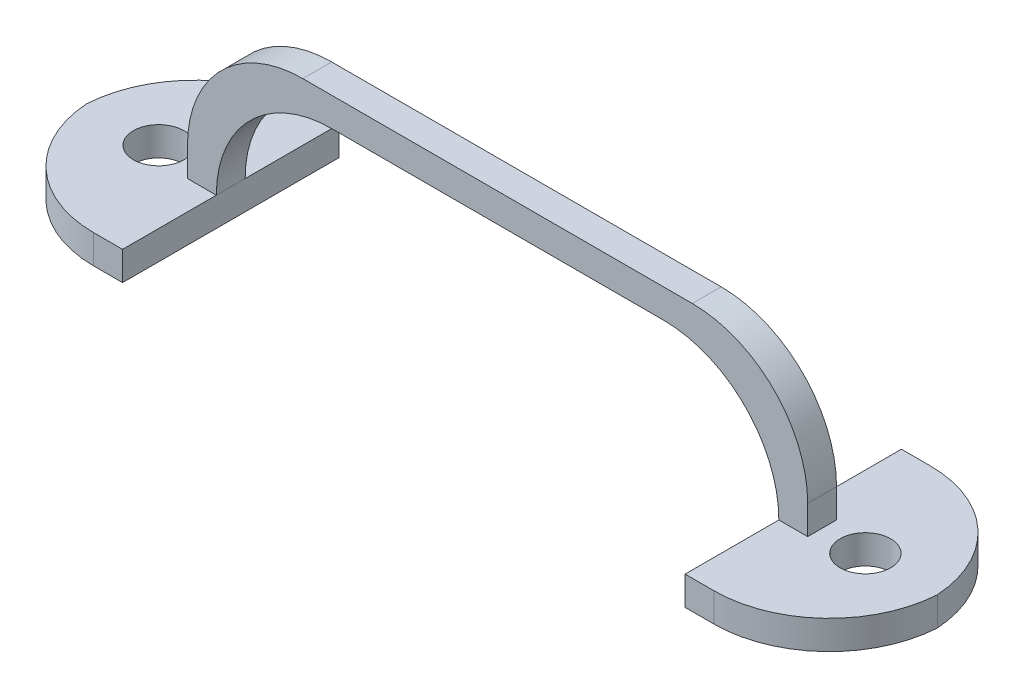
ISO-10303-21;
HEADER;
FILE_DESCRIPTION(('STEP AP214'),'2;1');
FILE_NAME('part.step','',(''),(''),'','','');
FILE_SCHEMA(('AUTOMOTIVE_DESIGN { 1 0 10303 214 1 1 1 1 }'));
ENDSEC;
DATA;
#1=APPLICATION_CONTEXT('core data for automotive mechanical design processes');
#2=APPLICATION_PROTOCOL_DEFINITION('international standard','automotive_design',2000,#1);
#3=PRODUCT_CONTEXT('',#1,'mechanical');
#4=PRODUCT('Part','Part','',(#3));
#5=PRODUCT_RELATED_PRODUCT_CATEGORY('part','',(#4));
#6=PRODUCT_DEFINITION_FORMATION('','',#4);
#7=PRODUCT_DEFINITION_CONTEXT('part definition',#1,'design');
#8=PRODUCT_DEFINITION('design','',#6,#7);
#9=PRODUCT_DEFINITION_SHAPE('','',#8);
#10=(LENGTH_UNIT() NAMED_UNIT(*) SI_UNIT(.MILLI.,.METRE.));
#11=(NAMED_UNIT(*) PLANE_ANGLE_UNIT() SI_UNIT($,.RADIAN.));
#12=(NAMED_UNIT(*) SI_UNIT($,.STERADIAN.) SOLID_ANGLE_UNIT());
#13=UNCERTAINTY_MEASURE_WITH_UNIT(LENGTH_MEASURE(1.E-05),#10,'distance_accuracy_value','');
#14=(GEOMETRIC_REPRESENTATION_CONTEXT(3) GLOBAL_UNCERTAINTY_ASSIGNED_CONTEXT((#13)) GLOBAL_UNIT_ASSIGNED_CONTEXT((#10,
#11,#12)) REPRESENTATION_CONTEXT('',''));
#15=CARTESIAN_POINT('',(0.,0.,0.));
#16=DIRECTION('',(0.,0.,1.));
#17=DIRECTION('',(1.,0.,0.));
#18=AXIS2_PLACEMENT_3D('',#15,#16,#17);
#19=CARTESIAN_POINT('',(0.,2.,0.));
#20=DIRECTION('',(0.,-1.,0.));
#21=DIRECTION('',(0.,0.,-1.));
#22=AXIS2_PLACEMENT_3D('',#19,#20,#21);
#23=PLANE('',#22);
#24=CARTESIAN_POINT('',(-17.6095226530613,2.,8.67295734693881));
#25=DIRECTION('',(0.,1.,0.));
#26=DIRECTION('',(0.,0.,1.));
#27=AXIS2_PLACEMENT_3D('',#24,#25,#26);
#28=CIRCLE('',#27,1.75);
#29=CARTESIAN_POINT('',(-17.6095226530613,2.,10.4229573469388));
#30=VERTEX_POINT('',#29);
#31=EDGE_CURVE('E287',#30,#30,#28,.T.);
#32=ORIENTED_EDGE('',*,*,#31,.F.);
#33=EDGE_LOOP('',(#32));
#34=FACE_BOUND('',#33,.T.);
#35=DIRECTION('',(1.,0.,0.));
#36=VECTOR('',#35,1.);
#37=CARTESIAN_POINT('',(-22.6095226530613,2.,1.17295734693881));
#38=LINE('',#37,#36);
#39=CARTESIAN_POINT('',(-14.6095226530613,2.,1.17295734693881));
#40=VERTEX_POINT('',#39);
#41=CARTESIAN_POINT('',(-12.6095226530613,2.,1.17295734693881));
#42=VERTEX_POINT('',#41);
#43=EDGE_CURVE('E300',#40,#42,#38,.T.);
#44=ORIENTED_EDGE('',*,*,#43,.F.);
#45=CARTESIAN_POINT('',(-14.6095226530613,2.,9.17295734693881));
#46=DIRECTION('',(0.,-1.,0.));
#47=DIRECTION('',(0.,0.,-1.));
#48=AXIS2_PLACEMENT_3D('',#45,#46,#47);
#49=CIRCLE('',#48,8.);
#50=CARTESIAN_POINT('',(-22.5938823643969,2.,8.67295734693881));
#51=VERTEX_POINT('',#50);
#52=EDGE_CURVE('E322',#40,#51,#49,.F.);
#53=ORIENTED_EDGE('',*,*,#52,.T.);
#54=CARTESIAN_POINT('',(-14.6095226530613,2.,8.17295734693881));
#55=DIRECTION('',(0.,-1.,0.));
#56=DIRECTION('',(0.,0.,-1.));
#57=AXIS2_PLACEMENT_3D('',#54,#55,#56);
#58=CIRCLE('',#57,8.);
#59=CARTESIAN_POINT('',(-14.6095226530613,2.,16.1729573469388));
#60=VERTEX_POINT('',#59);
#61=EDGE_CURVE('E320',#51,#60,#58,.F.);
#62=ORIENTED_EDGE('',*,*,#61,.T.);
#63=DIRECTION('',(1.,0.,0.));
#64=VECTOR('',#63,1.);
#65=CARTESIAN_POINT('',(-22.6095226530613,2.,16.1729573469388));
#66=LINE('',#65,#64);
#67=CARTESIAN_POINT('',(-12.6095226530613,2.,16.1729573469388));
#68=VERTEX_POINT('',#67);
#69=EDGE_CURVE('E293',#60,#68,#66,.T.);
#70=ORIENTED_EDGE('',*,*,#69,.T.);
#71=DIRECTION('',(0.,0.,1.));
#72=VECTOR('',#71,1.);
#73=CARTESIAN_POINT('',(-12.6095226530613,2.,1.17295734693881));
#74=LINE('',#73,#72);
#75=CARTESIAN_POINT('',(-12.6095226530613,2.,9.67295734693881));
#76=VERTEX_POINT('',#75);
#77=EDGE_CURVE('E295',#76,#68,#74,.T.);
#78=ORIENTED_EDGE('',*,*,#77,.F.);
#79=DIRECTION('',(1.,0.,0.));
#80=VECTOR('',#79,1.);
#81=CARTESIAN_POINT('',(-12.6095226530613,2.,9.67295734693881));
#82=LINE('',#81,#80);
#83=CARTESIAN_POINT('',(-14.6095226530613,2.,9.67295734693881));
#84=VERTEX_POINT('',#83);
#85=EDGE_CURVE('E248',#84,#76,#82,.T.);
#86=ORIENTED_EDGE('',*,*,#85,.F.);
#87=DIRECTION('',(0.,0.,1.));
#88=VECTOR('',#87,1.);
#89=CARTESIAN_POINT('',(-14.6095226530613,2.,7.67295734693881));
#90=LINE('',#89,#88);
#91=CARTESIAN_POINT('',(-14.6095226530613,2.,7.67295734693881));
#92=VERTEX_POINT('',#91);
#93=EDGE_CURVE('E282',#92,#84,#90,.T.);
#94=ORIENTED_EDGE('',*,*,#93,.F.);
#95=DIRECTION('',(1.,0.,0.));
#96=VECTOR('',#95,1.);
#97=CARTESIAN_POINT('',(-12.6095226530613,2.,7.67295734693881));
#98=LINE('',#97,#96);
#99=CARTESIAN_POINT('',(-12.6095226530613,2.,7.67295734693881));
#100=VERTEX_POINT('',#99);
#101=EDGE_CURVE('E265',#92,#100,#98,.T.);
#102=ORIENTED_EDGE('',*,*,#101,.T.);
#103=EDGE_CURVE('E297',#42,#100,#74,.T.);
#104=ORIENTED_EDGE('',*,*,#103,.F.);
#105=EDGE_LOOP('',(#44,#53,#62,#70,#78,#86,#94,#102,#104));
#106=FACE_BOUND('',#105,.T.);
#107=ADVANCED_FACE('F68',(#34,#106),#23,.F.);
#108=CARTESIAN_POINT('',(0.,0.,0.));
#109=DIRECTION('',(0.,-1.,0.));
#110=DIRECTION('',(0.,0.,-1.));
#111=AXIS2_PLACEMENT_3D('',#108,#109,#110);
#112=PLANE('',#111);
#113=CARTESIAN_POINT('',(-14.6095226530613,0.,8.17295734693881));
#114=DIRECTION('',(0.,-1.,0.));
#115=DIRECTION('',(0.,0.,-1.));
#116=AXIS2_PLACEMENT_3D('',#113,#114,#115);
#117=CIRCLE('',#116,8.);
#118=CARTESIAN_POINT('',(-14.6095226530613,0.,16.1729573469388));
#119=VERTEX_POINT('',#118);
#120=CARTESIAN_POINT('',(-22.5938823643969,0.,8.67295734693881));
#121=VERTEX_POINT('',#120);
#122=EDGE_CURVE('E313',#119,#121,#117,.T.);
#123=ORIENTED_EDGE('',*,*,#122,.T.);
#124=CARTESIAN_POINT('',(-14.6095226530613,0.,9.17295734693881));
#125=DIRECTION('',(0.,-1.,0.));
#126=DIRECTION('',(0.,0.,-1.));
#127=AXIS2_PLACEMENT_3D('',#124,#125,#126);
#128=CIRCLE('',#127,8.);
#129=CARTESIAN_POINT('',(-14.6095226530613,0.,1.17295734693881));
#130=VERTEX_POINT('',#129);
#131=EDGE_CURVE('E315',#121,#130,#128,.T.);
#132=ORIENTED_EDGE('',*,*,#131,.T.);
#133=DIRECTION('',(1.,0.,0.));
#134=VECTOR('',#133,1.);
#135=CARTESIAN_POINT('',(-22.6095226530613,0.,1.17295734693881));
#136=LINE('',#135,#134);
#137=CARTESIAN_POINT('',(-12.6095226530613,0.,1.17295734693881));
#138=VERTEX_POINT('',#137);
#139=EDGE_CURVE('E296',#130,#138,#136,.T.);
#140=ORIENTED_EDGE('',*,*,#139,.T.);
#141=DIRECTION('',(0.,0.,1.));
#142=VECTOR('',#141,1.);
#143=CARTESIAN_POINT('',(-12.6095226530613,0.,1.17295734693881));
#144=LINE('',#143,#142);
#145=CARTESIAN_POINT('',(-12.6095226530613,0.,16.1729573469388));
#146=VERTEX_POINT('',#145);
#147=EDGE_CURVE('E304',#138,#146,#144,.T.);
#148=ORIENTED_EDGE('',*,*,#147,.T.);
#149=DIRECTION('',(1.,0.,0.));
#150=VECTOR('',#149,1.);
#151=CARTESIAN_POINT('',(-22.6095226530613,0.,16.1729573469388));
#152=LINE('',#151,#150);
#153=EDGE_CURVE('E290',#119,#146,#152,.T.);
#154=ORIENTED_EDGE('',*,*,#153,.F.);
#155=EDGE_LOOP('',(#123,#132,#140,#148,#154));
#156=FACE_BOUND('',#155,.T.);
#157=CARTESIAN_POINT('',(-17.6095226530613,0.,8.67295734693881));
#158=DIRECTION('',(0.,1.,0.));
#159=DIRECTION('',(0.,0.,1.));
#160=AXIS2_PLACEMENT_3D('',#157,#158,#159);
#161=CIRCLE('',#160,1.75);
#162=CARTESIAN_POINT('',(-17.6095226530613,0.,10.4229573469388));
#163=VERTEX_POINT('',#162);
#164=EDGE_CURVE('E285',#163,#163,#161,.T.);
#165=ORIENTED_EDGE('',*,*,#164,.T.);
#166=EDGE_LOOP('',(#165));
#167=FACE_BOUND('',#166,.T.);
#168=ADVANCED_FACE('F430',(#156,#167),#112,.T.);
#169=CARTESIAN_POINT('',(-22.6095226530613,2.,16.1729573469388));
#170=DIRECTION('',(0.,0.,-1.));
#171=DIRECTION('',(-1.,0.,0.));
#172=AXIS2_PLACEMENT_3D('',#169,#170,#171);
#173=PLANE('',#172);
#174=ORIENTED_EDGE('',*,*,#69,.F.);
#175=DIRECTION('',(0.,-1.,0.));
#176=VECTOR('',#175,1.);
#177=CARTESIAN_POINT('',(-14.6095226530613,2.,16.1729573469388));
#178=LINE('',#177,#176);
#179=EDGE_CURVE('E324',#60,#119,#178,.T.);
#180=ORIENTED_EDGE('',*,*,#179,.T.);
#181=ORIENTED_EDGE('',*,*,#153,.T.);
#182=DIRECTION('',(0.,-1.,0.));
#183=VECTOR('',#182,1.);
#184=CARTESIAN_POINT('',(-12.6095226530613,2.,16.1729573469388));
#185=LINE('',#184,#183);
#186=EDGE_CURVE('E310',#68,#146,#185,.T.);
#187=ORIENTED_EDGE('',*,*,#186,.F.);
#188=EDGE_LOOP('',(#174,#180,#181,#187));
#189=FACE_BOUND('',#188,.T.);
#190=ADVANCED_FACE('F427',(#189),#173,.F.);
#191=CARTESIAN_POINT('',(-12.6095226530613,2.,1.17295734693881));
#192=DIRECTION('',(1.,0.,0.));
#193=DIRECTION('',(0.,0.,-1.));
#194=AXIS2_PLACEMENT_3D('',#191,#192,#193);
#195=PLANE('',#194);
#196=ORIENTED_EDGE('',*,*,#103,.T.);
#197=DIRECTION('',(0.,0.,1.));
#198=VECTOR('',#197,1.);
#199=CARTESIAN_POINT('',(-12.6095226530613,1.99999999999999,9.67295734693881));
#200=LINE('',#199,#198);
#201=EDGE_CURVE('E354',#100,#76,#200,.T.);
#202=ORIENTED_EDGE('',*,*,#201,.T.);
#203=ORIENTED_EDGE('',*,*,#77,.T.);
#204=ORIENTED_EDGE('',*,*,#186,.T.);
#205=ORIENTED_EDGE('',*,*,#147,.F.);
#206=DIRECTION('',(0.,-1.,0.));
#207=VECTOR('',#206,1.);
#208=CARTESIAN_POINT('',(-12.6095226530613,2.,1.17295734693881));
#209=LINE('',#208,#207);
#210=EDGE_CURVE('E302',#42,#138,#209,.T.);
#211=ORIENTED_EDGE('',*,*,#210,.F.);
#212=EDGE_LOOP('',(#196,#202,#203,#204,#205,#211));
#213=FACE_BOUND('',#212,.T.);
#214=ADVANCED_FACE('F412',(#213),#195,.T.);
#215=CARTESIAN_POINT('',(-22.6095226530613,2.,1.17295734693881));
#216=DIRECTION('',(0.,0.,-1.));
#217=DIRECTION('',(-1.,0.,0.));
#218=AXIS2_PLACEMENT_3D('',#215,#216,#217);
#219=PLANE('',#218);
#220=ORIENTED_EDGE('',*,*,#139,.F.);
#221=DIRECTION('',(0.,-1.,0.));
#222=VECTOR('',#221,1.);
#223=CARTESIAN_POINT('',(-14.6095226530613,2.,1.17295734693881));
#224=LINE('',#223,#222);
#225=EDGE_CURVE('E317',#130,#40,#224,.F.);
#226=ORIENTED_EDGE('',*,*,#225,.T.);
#227=ORIENTED_EDGE('',*,*,#43,.T.);
#228=ORIENTED_EDGE('',*,*,#210,.T.);
#229=EDGE_LOOP('',(#220,#226,#227,#228));
#230=FACE_BOUND('',#229,.T.);
#231=ADVANCED_FACE('F417',(#230),#219,.T.);
#232=CARTESIAN_POINT('',(-17.6095226530613,2.,8.67295734693881));
#233=DIRECTION('',(0.,-1.,0.));
#234=DIRECTION('',(0.,0.,-1.));
#235=AXIS2_PLACEMENT_3D('',#232,#233,#234);
#236=CYLINDRICAL_SURFACE('',#235,1.75);
#237=ORIENTED_EDGE('',*,*,#31,.T.);
#238=EDGE_LOOP('',(#237));
#239=FACE_BOUND('',#238,.T.);
#240=ORIENTED_EDGE('',*,*,#164,.F.);
#241=EDGE_LOOP('',(#240));
#242=FACE_BOUND('',#241,.T.);
#243=ADVANCED_FACE('F452',(#239,#242),#236,.F.);
#244=CARTESIAN_POINT('',(-14.6095226530613,12.,7.67295734693881));
#245=DIRECTION('',(-1.,0.,0.));
#246=DIRECTION('',(0.,0.,1.));
#247=AXIS2_PLACEMENT_3D('',#244,#245,#246);
#248=PLANE('',#247);
#249=DIRECTION('',(0.,-1.,0.));
#250=VECTOR('',#249,1.);
#251=CARTESIAN_POINT('',(-14.6095226530613,12.,9.67295734693881));
#252=LINE('',#251,#250);
#253=CARTESIAN_POINT('',(-14.6095226530613,3.99999999999999,9.67295734693881));
#254=VERTEX_POINT('',#253);
#255=EDGE_CURVE('E263',#254,#84,#252,.T.);
#256=ORIENTED_EDGE('',*,*,#255,.F.);
#257=DIRECTION('',(0.,0.,1.));
#258=VECTOR('',#257,1.);
#259=CARTESIAN_POINT('',(-14.6095226530613,3.99999999999999,7.67295734693881));
#260=LINE('',#259,#258);
#261=CARTESIAN_POINT('',(-14.6095226530613,3.99999999999999,7.67295734693881));
#262=VERTEX_POINT('',#261);
#263=EDGE_CURVE('E85',#254,#262,#260,.F.);
#264=ORIENTED_EDGE('',*,*,#263,.T.);
#265=DIRECTION('',(0.,-1.,0.));
#266=VECTOR('',#265,1.);
#267=CARTESIAN_POINT('',(-14.6095226530613,12.,7.67295734693881));
#268=LINE('',#267,#266);
#269=EDGE_CURVE('E279',#262,#92,#268,.T.);
#270=ORIENTED_EDGE('',*,*,#269,.T.);
#271=ORIENTED_EDGE('',*,*,#93,.T.);
#272=EDGE_LOOP('',(#256,#264,#270,#271));
#273=FACE_BOUND('',#272,.T.);
#274=ADVANCED_FACE('F478',(#273),#248,.T.);
#275=CARTESIAN_POINT('',(28.3904773469388,12.,7.67295734693881));
#276=DIRECTION('',(0.,1.,0.));
#277=DIRECTION('',(-1.,0.,0.));
#278=AXIS2_PLACEMENT_3D('',#275,#276,#277);
#279=PLANE('',#278);
#280=DIRECTION('',(-1.,0.,0.));
#281=VECTOR('',#280,1.);
#282=CARTESIAN_POINT('',(28.3904773469388,12.,9.67295734693881));
#283=LINE('',#282,#281);
#284=CARTESIAN_POINT('',(20.3904773469388,12.,9.67295734693881));
#285=VERTEX_POINT('',#284);
#286=CARTESIAN_POINT('',(-6.60952265306125,12.,9.67295734693881));
#287=VERTEX_POINT('',#286);
#288=EDGE_CURVE('E261',#285,#287,#283,.T.);
#289=ORIENTED_EDGE('',*,*,#288,.F.);
#290=DIRECTION('',(0.,0.,1.));
#291=VECTOR('',#290,1.);
#292=CARTESIAN_POINT('',(20.3904773469388,12.,7.67295734693881));
#293=LINE('',#292,#291);
#294=CARTESIAN_POINT('',(20.3904773469388,12.,7.67295734693881));
#295=VERTEX_POINT('',#294);
#296=EDGE_CURVE('E344',#285,#295,#293,.F.);
#297=ORIENTED_EDGE('',*,*,#296,.T.);
#298=DIRECTION('',(-1.,0.,0.));
#299=VECTOR('',#298,1.);
#300=CARTESIAN_POINT('',(28.3904773469388,12.,7.67295734693881));
#301=LINE('',#300,#299);
#302=CARTESIAN_POINT('',(-6.60952265306125,12.,7.67295734693881));
#303=VERTEX_POINT('',#302);
#304=EDGE_CURVE('E276',#295,#303,#301,.T.);
#305=ORIENTED_EDGE('',*,*,#304,.T.);
#306=DIRECTION('',(0.,0.,1.));
#307=VECTOR('',#306,1.);
#308=CARTESIAN_POINT('',(-6.60952265306125,12.,7.67295734693881));
#309=LINE('',#308,#307);
#310=EDGE_CURVE('E341',#303,#287,#309,.T.);
#311=ORIENTED_EDGE('',*,*,#310,.T.);
#312=EDGE_LOOP('',(#289,#297,#305,#311));
#313=FACE_BOUND('',#312,.T.);
#314=ADVANCED_FACE('F485',(#313),#279,.T.);
#315=CARTESIAN_POINT('',(28.3904773469388,2.,7.67295734693881));
#316=DIRECTION('',(1.,0.,0.));
#317=DIRECTION('',(0.,0.,-1.));
#318=AXIS2_PLACEMENT_3D('',#315,#316,#317);
#319=PLANE('',#318);
#320=DIRECTION('',(0.,1.,0.));
#321=VECTOR('',#320,1.);
#322=CARTESIAN_POINT('',(28.3904773469388,2.,7.67295734693881));
#323=LINE('',#322,#321);
#324=CARTESIAN_POINT('',(28.3904773469388,2.,7.67295734693881));
#325=VERTEX_POINT('',#324);
#326=CARTESIAN_POINT('',(28.3904773469388,4.,7.67295734693881));
#327=VERTEX_POINT('',#326);
#328=EDGE_CURVE('E273',#325,#327,#323,.T.);
#329=ORIENTED_EDGE('',*,*,#328,.T.);
#330=DIRECTION('',(0.,0.,1.));
#331=VECTOR('',#330,1.);
#332=CARTESIAN_POINT('',(28.3904773469388,4.,7.67295734693881));
#333=LINE('',#332,#331);
#334=CARTESIAN_POINT('',(28.3904773469388,4.,9.67295734693881));
#335=VERTEX_POINT('',#334);
#336=EDGE_CURVE('E338',#327,#335,#333,.T.);
#337=ORIENTED_EDGE('',*,*,#336,.T.);
#338=DIRECTION('',(0.,1.,0.));
#339=VECTOR('',#338,1.);
#340=CARTESIAN_POINT('',(28.3904773469388,2.,9.67295734693881));
#341=LINE('',#340,#339);
#342=CARTESIAN_POINT('',(28.3904773469388,2.,9.67295734693881));
#343=VERTEX_POINT('',#342);
#344=EDGE_CURVE('E258',#343,#335,#341,.T.);
#345=ORIENTED_EDGE('',*,*,#344,.F.);
#346=DIRECTION('',(0.,0.,1.));
#347=VECTOR('',#346,1.);
#348=CARTESIAN_POINT('',(28.3904773469388,2.,7.67295734693881));
#349=LINE('',#348,#347);
#350=EDGE_CURVE('E281',#325,#343,#349,.T.);
#351=ORIENTED_EDGE('',*,*,#350,.F.);
#352=EDGE_LOOP('',(#329,#337,#345,#351));
#353=FACE_BOUND('',#352,.T.);
#354=ADVANCED_FACE('F492',(#353),#319,.T.);
#355=CARTESIAN_POINT('',(26.3904773469388,9.99999999999999,7.67295734693881));
#356=DIRECTION('',(-1.,0.,0.));
#357=DIRECTION('',(0.,0.,1.));
#358=AXIS2_PLACEMENT_3D('',#355,#356,#357);
#359=PLANE('',#358);
#360=DIRECTION('',(0.,0.,1.));
#361=VECTOR('',#360,1.);
#362=CARTESIAN_POINT('',(26.3904773469388,2.,1.17295734693881));
#363=LINE('',#362,#361);
#364=CARTESIAN_POINT('',(26.3904773469388,2.,9.67295734693881));
#365=VERTEX_POINT('',#364);
#366=CARTESIAN_POINT('',(26.3904773469388,2.,16.1729573469388));
#367=VERTEX_POINT('',#366);
#368=EDGE_CURVE('E227',#365,#367,#363,.T.);
#369=ORIENTED_EDGE('',*,*,#368,.F.);
#370=DIRECTION('',(0.,0.,1.));
#371=VECTOR('',#370,1.);
#372=CARTESIAN_POINT('',(26.3904773469388,1.99999999999999,7.67295734693881));
#373=LINE('',#372,#371);
#374=CARTESIAN_POINT('',(26.3904773469388,2.,7.67295734693881));
#375=VERTEX_POINT('',#374);
#376=EDGE_CURVE('E351',#365,#375,#373,.F.);
#377=ORIENTED_EDGE('',*,*,#376,.T.);
#378=CARTESIAN_POINT('',(26.3904773469388,2.,1.17295734693881));
#379=VERTEX_POINT('',#378);
#380=EDGE_CURVE('E240',#379,#375,#363,.T.);
#381=ORIENTED_EDGE('',*,*,#380,.F.);
#382=DIRECTION('',(0.,-1.,0.));
#383=VECTOR('',#382,1.);
#384=CARTESIAN_POINT('',(26.3904773469388,2.,1.17295734693881));
#385=LINE('',#384,#383);
#386=CARTESIAN_POINT('',(26.3904773469388,0.,1.17295734693881));
#387=VERTEX_POINT('',#386);
#388=EDGE_CURVE('E213',#379,#387,#385,.T.);
#389=ORIENTED_EDGE('',*,*,#388,.T.);
#390=DIRECTION('',(0.,0.,1.));
#391=VECTOR('',#390,1.);
#392=CARTESIAN_POINT('',(26.3904773469388,0.,1.17295734693881));
#393=LINE('',#392,#391);
#394=CARTESIAN_POINT('',(26.3904773469388,0.,16.1729573469388));
#395=VERTEX_POINT('',#394);
#396=EDGE_CURVE('E206',#387,#395,#393,.T.);
#397=ORIENTED_EDGE('',*,*,#396,.T.);
#398=DIRECTION('',(0.,-1.,0.));
#399=VECTOR('',#398,1.);
#400=CARTESIAN_POINT('',(26.3904773469388,2.,16.1729573469388));
#401=LINE('',#400,#399);
#402=EDGE_CURVE('E210',#367,#395,#401,.T.);
#403=ORIENTED_EDGE('',*,*,#402,.F.);
#404=EDGE_LOOP('',(#369,#377,#381,#389,#397,#403));
#405=FACE_BOUND('',#404,.T.);
#406=ADVANCED_FACE('F209',(#405),#359,.T.);
#407=CARTESIAN_POINT('',(-12.6095226530613,9.99999999999999,7.67295734693881));
#408=DIRECTION('',(0.,-1.,0.));
#409=DIRECTION('',(0.,0.,-1.));
#410=AXIS2_PLACEMENT_3D('',#407,#408,#409);
#411=PLANE('',#410);
#412=DIRECTION('',(1.,0.,0.));
#413=VECTOR('',#412,1.);
#414=CARTESIAN_POINT('',(-12.6095226530613,9.99999999999999,7.67295734693881));
#415=LINE('',#414,#413);
#416=CARTESIAN_POINT('',(-4.60952265306125,9.99999999999999,7.67295734693881));
#417=VERTEX_POINT('',#416);
#418=CARTESIAN_POINT('',(18.3904773469388,9.99999999999999,7.67295734693881));
#419=VERTEX_POINT('',#418);
#420=EDGE_CURVE('E268',#417,#419,#415,.T.);
#421=ORIENTED_EDGE('',*,*,#420,.T.);
#422=DIRECTION('',(0.,0.,1.));
#423=VECTOR('',#422,1.);
#424=CARTESIAN_POINT('',(18.3904773469388,9.99999999999999,9.67295734693881));
#425=LINE('',#424,#423);
#426=CARTESIAN_POINT('',(18.3904773469388,9.99999999999999,9.67295734693881));
#427=VERTEX_POINT('',#426);
#428=EDGE_CURVE('E348',#419,#427,#425,.T.);
#429=ORIENTED_EDGE('',*,*,#428,.T.);
#430=DIRECTION('',(1.,0.,0.));
#431=VECTOR('',#430,1.);
#432=CARTESIAN_POINT('',(-12.6095226530613,9.99999999999999,9.67295734693881));
#433=LINE('',#432,#431);
#434=CARTESIAN_POINT('',(-4.60952265306125,9.99999999999999,9.67295734693881));
#435=VERTEX_POINT('',#434);
#436=EDGE_CURVE('E252',#435,#427,#433,.T.);
#437=ORIENTED_EDGE('',*,*,#436,.F.);
#438=DIRECTION('',(0.,0.,1.));
#439=VECTOR('',#438,1.);
#440=CARTESIAN_POINT('',(-4.60952265306125,9.99999999999999,7.67295734693881));
#441=LINE('',#440,#439);
#442=EDGE_CURVE('E346',#435,#417,#441,.F.);
#443=ORIENTED_EDGE('',*,*,#442,.T.);
#444=EDGE_LOOP('',(#421,#429,#437,#443));
#445=FACE_BOUND('',#444,.T.);
#446=ADVANCED_FACE('F399',(#445),#411,.T.);
#447=CARTESIAN_POINT('',(0.,0.,7.67295734693881));
#448=DIRECTION('',(0.,0.,1.));
#449=DIRECTION('',(1.,0.,0.));
#450=AXIS2_PLACEMENT_3D('',#447,#448,#449);
#451=PLANE('',#450);
#452=ORIENTED_EDGE('',*,*,#304,.F.);
#453=CARTESIAN_POINT('',(20.3904773469388,4.,7.67295734693881));
#454=DIRECTION('',(0.,0.,1.));
#455=DIRECTION('',(1.,0.,0.));
#456=AXIS2_PLACEMENT_3D('',#453,#454,#455);
#457=CIRCLE('',#456,8.);
#458=EDGE_CURVE('E12',#295,#327,#457,.F.);
#459=ORIENTED_EDGE('',*,*,#458,.T.);
#460=ORIENTED_EDGE('',*,*,#328,.F.);
#461=DIRECTION('',(1.,0.,0.));
#462=VECTOR('',#461,1.);
#463=CARTESIAN_POINT('',(26.3904773469388,2.,7.67295734693881));
#464=LINE('',#463,#462);
#465=EDGE_CURVE('E271',#375,#325,#464,.T.);
#466=ORIENTED_EDGE('',*,*,#465,.F.);
#467=CARTESIAN_POINT('',(18.3904773469388,1.99999999999999,7.67295734693881));
#468=DIRECTION('',(0.,0.,1.));
#469=DIRECTION('',(1.,0.,0.));
#470=AXIS2_PLACEMENT_3D('',#467,#468,#469);
#471=CIRCLE('',#470,8.);
#472=EDGE_CURVE('E359',#375,#419,#471,.T.);
#473=ORIENTED_EDGE('',*,*,#472,.T.);
#474=ORIENTED_EDGE('',*,*,#420,.F.);
#475=CARTESIAN_POINT('',(-4.60952265306125,1.99999999999999,7.67295734693881));
#476=DIRECTION('',(0.,0.,1.));
#477=DIRECTION('',(1.,0.,0.));
#478=AXIS2_PLACEMENT_3D('',#475,#476,#477);
#479=CIRCLE('',#478,8.);
#480=EDGE_CURVE('E363',#417,#100,#479,.T.);
#481=ORIENTED_EDGE('',*,*,#480,.T.);
#482=ORIENTED_EDGE('',*,*,#101,.F.);
#483=ORIENTED_EDGE('',*,*,#269,.F.);
#484=CARTESIAN_POINT('',(-6.60952265306125,4.,7.67295734693881));
#485=DIRECTION('',(0.,0.,1.));
#486=DIRECTION('',(1.,0.,0.));
#487=AXIS2_PLACEMENT_3D('',#484,#485,#486);
#488=CIRCLE('',#487,8.);
#489=EDGE_CURVE('E77',#262,#303,#488,.F.);
#490=ORIENTED_EDGE('',*,*,#489,.T.);
#491=EDGE_LOOP('',(#452,#459,#460,#466,#473,#474,#481,#482,#483,#490));
#492=FACE_BOUND('',#491,.T.);
#493=ADVANCED_FACE('F395',(#492),#451,.F.);
#494=CARTESIAN_POINT('',(0.,0.,9.67295734693881));
#495=DIRECTION('',(0.,0.,1.));
#496=DIRECTION('',(1.,0.,0.));
#497=AXIS2_PLACEMENT_3D('',#494,#495,#496);
#498=PLANE('',#497);
#499=ORIENTED_EDGE('',*,*,#344,.T.);
#500=CARTESIAN_POINT('',(20.3904773469388,4.,9.67295734693881));
#501=DIRECTION('',(0.,0.,1.));
#502=DIRECTION('',(1.,0.,0.));
#503=AXIS2_PLACEMENT_3D('',#500,#501,#502);
#504=CIRCLE('',#503,8.);
#505=EDGE_CURVE('E366',#335,#285,#504,.T.);
#506=ORIENTED_EDGE('',*,*,#505,.T.);
#507=ORIENTED_EDGE('',*,*,#288,.T.);
#508=CARTESIAN_POINT('',(-6.60952265306125,4.,9.67295734693881));
#509=DIRECTION('',(0.,0.,1.));
#510=DIRECTION('',(1.,0.,0.));
#511=AXIS2_PLACEMENT_3D('',#508,#509,#510);
#512=CIRCLE('',#511,8.);
#513=EDGE_CURVE('E93',#287,#254,#512,.T.);
#514=ORIENTED_EDGE('',*,*,#513,.T.);
#515=ORIENTED_EDGE('',*,*,#255,.T.);
#516=ORIENTED_EDGE('',*,*,#85,.T.);
#517=CARTESIAN_POINT('',(-4.60952265306125,1.99999999999999,9.67295734693881));
#518=DIRECTION('',(0.,0.,1.));
#519=DIRECTION('',(1.,0.,0.));
#520=AXIS2_PLACEMENT_3D('',#517,#518,#519);
#521=CIRCLE('',#520,8.);
#522=EDGE_CURVE('E361',#76,#435,#521,.F.);
#523=ORIENTED_EDGE('',*,*,#522,.T.);
#524=ORIENTED_EDGE('',*,*,#436,.T.);
#525=CARTESIAN_POINT('',(18.3904773469388,1.99999999999999,9.67295734693881));
#526=DIRECTION('',(0.,0.,1.));
#527=DIRECTION('',(1.,0.,0.));
#528=AXIS2_PLACEMENT_3D('',#525,#526,#527);
#529=CIRCLE('',#528,8.);
#530=EDGE_CURVE('E357',#427,#365,#529,.F.);
#531=ORIENTED_EDGE('',*,*,#530,.T.);
#532=DIRECTION('',(1.,0.,0.));
#533=VECTOR('',#532,1.);
#534=CARTESIAN_POINT('',(26.3904773469388,2.,9.67295734693881));
#535=LINE('',#534,#533);
#536=EDGE_CURVE('E255',#365,#343,#535,.T.);
#537=ORIENTED_EDGE('',*,*,#536,.T.);
#538=EDGE_LOOP('',(#499,#506,#507,#514,#515,#516,#523,#524,#531,#537));
#539=FACE_BOUND('',#538,.T.);
#540=ADVANCED_FACE('F518',(#539),#498,.T.);
#541=CARTESIAN_POINT('',(0.,2.,0.));
#542=DIRECTION('',(0.,-1.,0.));
#543=DIRECTION('',(0.,0.,-1.));
#544=AXIS2_PLACEMENT_3D('',#541,#542,#543);
#545=PLANE('',#544);
#546=CARTESIAN_POINT('',(31.3904773469387,2.,8.6729573469388));
#547=DIRECTION('',(0.,1.,0.));
#548=DIRECTION('',(0.,0.,1.));
#549=AXIS2_PLACEMENT_3D('',#546,#547,#548);
#550=CIRCLE('',#549,1.75);
#551=CARTESIAN_POINT('',(31.3904773469387,2.,10.4229573469388));
#552=VERTEX_POINT('',#551);
#553=EDGE_CURVE('E233',#552,#552,#550,.T.);
#554=ORIENTED_EDGE('',*,*,#553,.F.);
#555=EDGE_LOOP('',(#554));
#556=FACE_BOUND('',#555,.T.);
#557=CARTESIAN_POINT('',(28.3904773469387,2.,8.17295734693881));
#558=DIRECTION('',(0.,-1.,0.));
#559=DIRECTION('',(0.,0.,-1.));
#560=AXIS2_PLACEMENT_3D('',#557,#558,#559);
#561=CIRCLE('',#560,8.);
#562=CARTESIAN_POINT('',(28.3904773469387,2.,16.1729573469388));
#563=VERTEX_POINT('',#562);
#564=CARTESIAN_POINT('',(36.3748370582744,2.,8.67295734693881));
#565=VERTEX_POINT('',#564);
#566=EDGE_CURVE('E332',#563,#565,#561,.F.);
#567=ORIENTED_EDGE('',*,*,#566,.T.);
#568=CARTESIAN_POINT('',(28.3904773469387,2.,9.17295734693881));
#569=DIRECTION('',(0.,-1.,0.));
#570=DIRECTION('',(0.,0.,-1.));
#571=AXIS2_PLACEMENT_3D('',#568,#569,#570);
#572=CIRCLE('',#571,8.);
#573=CARTESIAN_POINT('',(28.3904773469387,2.,1.17295734693881));
#574=VERTEX_POINT('',#573);
#575=EDGE_CURVE('E334',#565,#574,#572,.F.);
#576=ORIENTED_EDGE('',*,*,#575,.T.);
#577=DIRECTION('',(1.,0.,0.));
#578=VECTOR('',#577,1.);
#579=CARTESIAN_POINT('',(26.3904773469388,2.,1.17295734693881));
#580=LINE('',#579,#578);
#581=EDGE_CURVE('E243',#379,#574,#580,.T.);
#582=ORIENTED_EDGE('',*,*,#581,.F.);
#583=ORIENTED_EDGE('',*,*,#380,.T.);
#584=ORIENTED_EDGE('',*,*,#465,.T.);
#585=ORIENTED_EDGE('',*,*,#350,.T.);
#586=ORIENTED_EDGE('',*,*,#536,.F.);
#587=ORIENTED_EDGE('',*,*,#368,.T.);
#588=DIRECTION('',(1.,0.,0.));
#589=VECTOR('',#588,1.);
#590=CARTESIAN_POINT('',(26.3904773469388,2.,16.1729573469388));
#591=LINE('',#590,#589);
#592=EDGE_CURVE('E219',#367,#563,#591,.T.);
#593=ORIENTED_EDGE('',*,*,#592,.T.);
#594=EDGE_LOOP('',(#567,#576,#582,#583,#584,#585,#586,#587,#593));
#595=FACE_BOUND('',#594,.T.);
#596=ADVANCED_FACE('F384',(#556,#595),#545,.F.);
#597=CARTESIAN_POINT('',(0.,0.,0.));
#598=DIRECTION('',(0.,-1.,0.));
#599=DIRECTION('',(0.,0.,-1.));
#600=AXIS2_PLACEMENT_3D('',#597,#598,#599);
#601=PLANE('',#600);
#602=DIRECTION('',(1.,0.,0.));
#603=VECTOR('',#602,1.);
#604=CARTESIAN_POINT('',(26.3904773469388,0.,1.17295734693881));
#605=LINE('',#604,#603);
#606=CARTESIAN_POINT('',(28.3904773469387,0.,1.17295734693881));
#607=VERTEX_POINT('',#606);
#608=EDGE_CURVE('E218',#387,#607,#605,.T.);
#609=ORIENTED_EDGE('',*,*,#608,.T.);
#610=CARTESIAN_POINT('',(28.3904773469387,0.,9.17295734693881));
#611=DIRECTION('',(0.,-1.,0.));
#612=DIRECTION('',(0.,0.,-1.));
#613=AXIS2_PLACEMENT_3D('',#610,#611,#612);
#614=CIRCLE('',#613,8.);
#615=CARTESIAN_POINT('',(36.3748370582744,0.,8.67295734693881));
#616=VERTEX_POINT('',#615);
#617=EDGE_CURVE('E330',#607,#616,#614,.T.);
#618=ORIENTED_EDGE('',*,*,#617,.T.);
#619=CARTESIAN_POINT('',(28.3904773469387,0.,8.17295734693881));
#620=DIRECTION('',(0.,-1.,0.));
#621=DIRECTION('',(0.,0.,-1.));
#622=AXIS2_PLACEMENT_3D('',#619,#620,#621);
#623=CIRCLE('',#622,8.);
#624=CARTESIAN_POINT('',(28.3904773469387,0.,16.1729573469388));
#625=VERTEX_POINT('',#624);
#626=EDGE_CURVE('E232',#616,#625,#623,.T.);
#627=ORIENTED_EDGE('',*,*,#626,.T.);
#628=DIRECTION('',(1.,0.,0.));
#629=VECTOR('',#628,1.);
#630=CARTESIAN_POINT('',(26.3904773469388,0.,16.1729573469388));
#631=LINE('',#630,#629);
#632=EDGE_CURVE('E224',#395,#625,#631,.T.);
#633=ORIENTED_EDGE('',*,*,#632,.F.);
#634=ORIENTED_EDGE('',*,*,#396,.F.);
#635=EDGE_LOOP('',(#609,#618,#627,#633,#634));
#636=FACE_BOUND('',#635,.T.);
#637=CARTESIAN_POINT('',(31.3904773469387,0.,8.6729573469388));
#638=DIRECTION('',(0.,1.,0.));
#639=DIRECTION('',(0.,0.,1.));
#640=AXIS2_PLACEMENT_3D('',#637,#638,#639);
#641=CIRCLE('',#640,1.75);
#642=CARTESIAN_POINT('',(31.3904773469387,0.,10.4229573469388));
#643=VERTEX_POINT('',#642);
#644=EDGE_CURVE('E236',#643,#643,#641,.T.);
#645=ORIENTED_EDGE('',*,*,#644,.T.);
#646=EDGE_LOOP('',(#645));
#647=FACE_BOUND('',#646,.T.);
#648=ADVANCED_FACE('F229',(#636,#647),#601,.T.);
#649=CARTESIAN_POINT('',(26.3904773469388,2.,16.1729573469388));
#650=DIRECTION('',(0.,0.,-1.));
#651=DIRECTION('',(-1.,0.,0.));
#652=AXIS2_PLACEMENT_3D('',#649,#650,#651);
#653=PLANE('',#652);
#654=ORIENTED_EDGE('',*,*,#632,.T.);
#655=DIRECTION('',(0.,-1.,0.));
#656=VECTOR('',#655,1.);
#657=CARTESIAN_POINT('',(28.3904773469387,2.,16.1729573469388));
#658=LINE('',#657,#656);
#659=EDGE_CURVE('E336',#625,#563,#658,.F.);
#660=ORIENTED_EDGE('',*,*,#659,.T.);
#661=ORIENTED_EDGE('',*,*,#592,.F.);
#662=ORIENTED_EDGE('',*,*,#402,.T.);
#663=EDGE_LOOP('',(#654,#660,#661,#662));
#664=FACE_BOUND('',#663,.T.);
#665=ADVANCED_FACE('F223',(#664),#653,.F.);
#666=CARTESIAN_POINT('',(26.3904773469388,2.,1.17295734693881));
#667=DIRECTION('',(0.,0.,-1.));
#668=DIRECTION('',(-1.,0.,0.));
#669=AXIS2_PLACEMENT_3D('',#666,#667,#668);
#670=PLANE('',#669);
#671=ORIENTED_EDGE('',*,*,#581,.T.);
#672=DIRECTION('',(0.,-1.,0.));
#673=VECTOR('',#672,1.);
#674=CARTESIAN_POINT('',(28.3904773469387,2.,1.17295734693881));
#675=LINE('',#674,#673);
#676=EDGE_CURVE('E326',#574,#607,#675,.T.);
#677=ORIENTED_EDGE('',*,*,#676,.T.);
#678=ORIENTED_EDGE('',*,*,#608,.F.);
#679=ORIENTED_EDGE('',*,*,#388,.F.);
#680=EDGE_LOOP('',(#671,#677,#678,#679));
#681=FACE_BOUND('',#680,.T.);
#682=ADVANCED_FACE('F544',(#681),#670,.T.);
#683=CARTESIAN_POINT('',(31.3904773469387,2.,8.6729573469388));
#684=DIRECTION('',(0.,-1.,0.));
#685=DIRECTION('',(0.,0.,-1.));
#686=AXIS2_PLACEMENT_3D('',#683,#684,#685);
#687=CYLINDRICAL_SURFACE('',#686,1.75);
#688=ORIENTED_EDGE('',*,*,#553,.T.);
#689=EDGE_LOOP('',(#688));
#690=FACE_BOUND('',#689,.T.);
#691=ORIENTED_EDGE('',*,*,#644,.F.);
#692=EDGE_LOOP('',(#691));
#693=FACE_BOUND('',#692,.T.);
#694=ADVANCED_FACE('F440',(#690,#693),#687,.F.);
#695=CARTESIAN_POINT('',(-14.6095226530613,2.,8.17295734693881));
#696=DIRECTION('',(0.,-1.,0.));
#697=DIRECTION('',(0.,0.,-1.));
#698=AXIS2_PLACEMENT_3D('',#695,#696,#697);
#699=CYLINDRICAL_SURFACE('',#698,8.);
#700=ORIENTED_EDGE('',*,*,#179,.F.);
#701=ORIENTED_EDGE('',*,*,#61,.F.);
#702=DIRECTION('',(0.,-1.,0.));
#703=VECTOR('',#702,1.);
#704=CARTESIAN_POINT('',(-22.5938823643969,1.,8.67295734693881));
#705=LINE('',#704,#703);
#706=EDGE_CURVE('E368',#121,#51,#705,.F.);
#707=ORIENTED_EDGE('',*,*,#706,.F.);
#708=ORIENTED_EDGE('',*,*,#122,.F.);
#709=EDGE_LOOP('',(#700,#701,#707,#708));
#710=FACE_BOUND('',#709,.T.);
#711=ADVANCED_FACE('F423',(#710),#699,.T.);
#712=CARTESIAN_POINT('',(-14.6095226530613,2.,9.17295734693881));
#713=DIRECTION('',(0.,1.,0.));
#714=DIRECTION('',(0.,0.,1.));
#715=AXIS2_PLACEMENT_3D('',#712,#713,#714);
#716=CYLINDRICAL_SURFACE('',#715,8.);
#717=ORIENTED_EDGE('',*,*,#52,.F.);
#718=ORIENTED_EDGE('',*,*,#225,.F.);
#719=ORIENTED_EDGE('',*,*,#131,.F.);
#720=ORIENTED_EDGE('',*,*,#706,.T.);
#721=EDGE_LOOP('',(#717,#718,#719,#720));
#722=FACE_BOUND('',#721,.T.);
#723=ADVANCED_FACE('F432',(#722),#716,.T.);
#724=CARTESIAN_POINT('',(28.3904773469387,2.,8.17295734693881));
#725=DIRECTION('',(0.,1.,0.));
#726=DIRECTION('',(0.,0.,1.));
#727=AXIS2_PLACEMENT_3D('',#724,#725,#726);
#728=CYLINDRICAL_SURFACE('',#727,8.);
#729=DIRECTION('',(0.,1.,0.));
#730=VECTOR('',#729,1.);
#731=CARTESIAN_POINT('',(36.3748370582744,1.,8.67295734693881));
#732=LINE('',#731,#730);
#733=EDGE_CURVE('E72',#565,#616,#732,.F.);
#734=ORIENTED_EDGE('',*,*,#733,.F.);
#735=ORIENTED_EDGE('',*,*,#566,.F.);
#736=ORIENTED_EDGE('',*,*,#659,.F.);
#737=ORIENTED_EDGE('',*,*,#626,.F.);
#738=EDGE_LOOP('',(#734,#735,#736,#737));
#739=FACE_BOUND('',#738,.T.);
#740=ADVANCED_FACE('F382',(#739),#728,.T.);
#741=CARTESIAN_POINT('',(28.3904773469387,2.,9.17295734693881));
#742=DIRECTION('',(0.,-1.,0.));
#743=DIRECTION('',(0.,0.,-1.));
#744=AXIS2_PLACEMENT_3D('',#741,#742,#743);
#745=CYLINDRICAL_SURFACE('',#744,8.);
#746=ORIENTED_EDGE('',*,*,#575,.F.);
#747=ORIENTED_EDGE('',*,*,#733,.T.);
#748=ORIENTED_EDGE('',*,*,#617,.F.);
#749=ORIENTED_EDGE('',*,*,#676,.F.);
#750=EDGE_LOOP('',(#746,#747,#748,#749));
#751=FACE_BOUND('',#750,.T.);
#752=ADVANCED_FACE('F378',(#751),#745,.T.);
#753=CARTESIAN_POINT('',(20.3904773469388,4.,7.67295734693881));
#754=DIRECTION('',(0.,0.,1.));
#755=DIRECTION('',(1.,0.,0.));
#756=AXIS2_PLACEMENT_3D('',#753,#754,#755);
#757=CYLINDRICAL_SURFACE('',#756,8.);
#758=ORIENTED_EDGE('',*,*,#458,.F.);
#759=ORIENTED_EDGE('',*,*,#296,.F.);
#760=ORIENTED_EDGE('',*,*,#505,.F.);
#761=ORIENTED_EDGE('',*,*,#336,.F.);
#762=EDGE_LOOP('',(#758,#759,#760,#761));
#763=FACE_BOUND('',#762,.T.);
#764=ADVANCED_FACE('F584',(#763),#757,.T.);
#765=CARTESIAN_POINT('',(18.3904773469388,1.99999999999999,7.67295734693881));
#766=DIRECTION('',(0.,0.,-1.));
#767=DIRECTION('',(-1.,0.,0.));
#768=AXIS2_PLACEMENT_3D('',#765,#766,#767);
#769=CYLINDRICAL_SURFACE('',#768,8.);
#770=ORIENTED_EDGE('',*,*,#472,.F.);
#771=ORIENTED_EDGE('',*,*,#376,.F.);
#772=ORIENTED_EDGE('',*,*,#530,.F.);
#773=ORIENTED_EDGE('',*,*,#428,.F.);
#774=EDGE_LOOP('',(#770,#771,#772,#773));
#775=FACE_BOUND('',#774,.T.);
#776=ADVANCED_FACE('F389',(#775),#769,.F.);
#777=CARTESIAN_POINT('',(-6.60952265306125,4.,7.67295734693881));
#778=DIRECTION('',(0.,0.,1.));
#779=DIRECTION('',(1.,0.,0.));
#780=AXIS2_PLACEMENT_3D('',#777,#778,#779);
#781=CYLINDRICAL_SURFACE('',#780,8.);
#782=ORIENTED_EDGE('',*,*,#489,.F.);
#783=ORIENTED_EDGE('',*,*,#263,.F.);
#784=ORIENTED_EDGE('',*,*,#513,.F.);
#785=ORIENTED_EDGE('',*,*,#310,.F.);
#786=EDGE_LOOP('',(#782,#783,#784,#785));
#787=FACE_BOUND('',#786,.T.);
#788=ADVANCED_FACE('F604',(#787),#781,.T.);
#789=CARTESIAN_POINT('',(-4.60952265306125,1.99999999999999,1.17295734693881));
#790=DIRECTION('',(0.,0.,-1.));
#791=DIRECTION('',(-1.,0.,0.));
#792=AXIS2_PLACEMENT_3D('',#789,#790,#791);
#793=CYLINDRICAL_SURFACE('',#792,8.);
#794=ORIENTED_EDGE('',*,*,#480,.F.);
#795=ORIENTED_EDGE('',*,*,#442,.F.);
#796=ORIENTED_EDGE('',*,*,#522,.F.);
#797=ORIENTED_EDGE('',*,*,#201,.F.);
#798=EDGE_LOOP('',(#794,#795,#796,#797));
#799=FACE_BOUND('',#798,.T.);
#800=ADVANCED_FACE('F70',(#799),#793,.F.);
#801=CLOSED_SHELL('',(#107,#168,#190,#214,#231,#243,#274,#314,#354,#406,#446,#493,#540,#596,
#648,#665,#682,#694,#711,#723,#740,#752,#764,#776,#788,#800));
#802=MANIFOLD_SOLID_BREP('B2',#801);
#803=ADVANCED_BREP_SHAPE_REPRESENTATION('',(#18,#802),#14);
#804=SHAPE_DEFINITION_REPRESENTATION(#9,#803);
ENDSEC;
END-ISO-10303-21;
